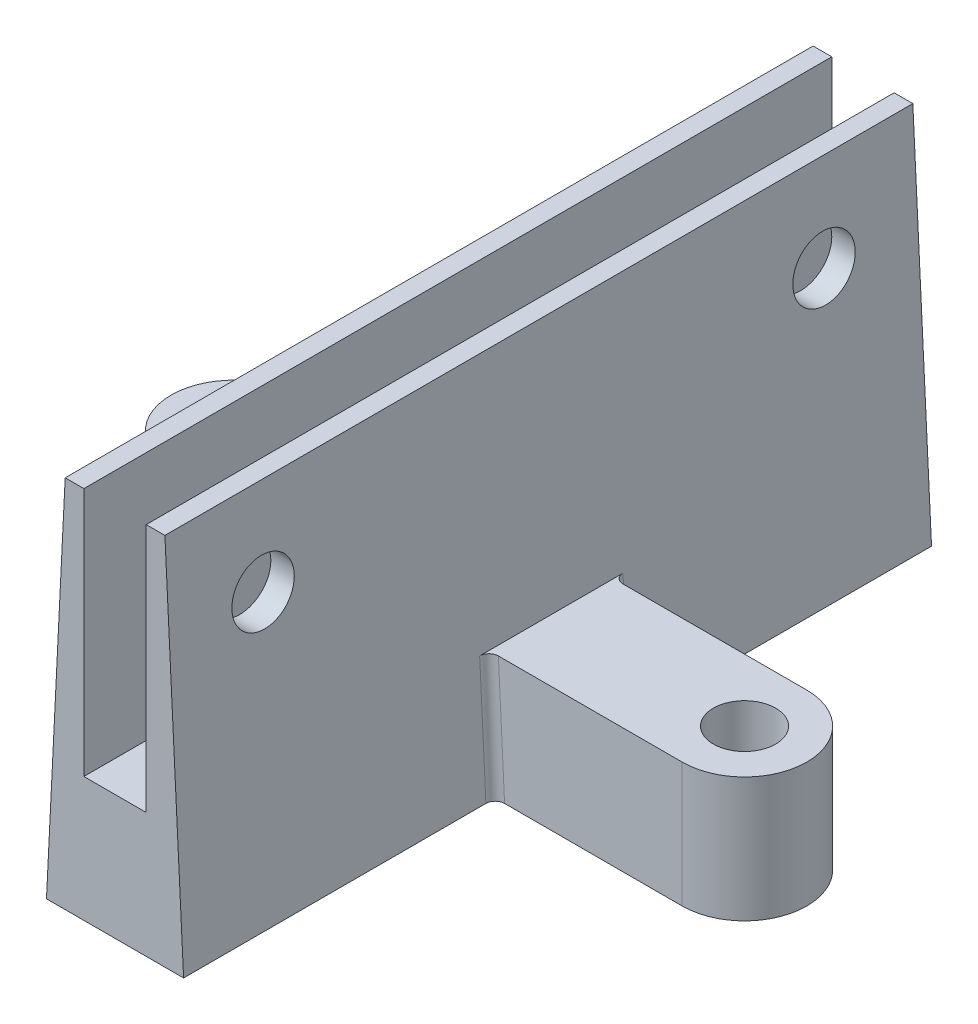
ISO-10303-21;
HEADER;
FILE_DESCRIPTION(('STEP AP214'),'2;1');
FILE_NAME('part.step','',(''),(''),'','','');
FILE_SCHEMA(('AUTOMOTIVE_DESIGN { 1 0 10303 214 1 1 1 1 }'));
ENDSEC;
DATA;
#1=APPLICATION_CONTEXT('core data for automotive mechanical design processes');
#2=APPLICATION_PROTOCOL_DEFINITION('international standard','automotive_design',2000,#1);
#3=PRODUCT_CONTEXT('',#1,'mechanical');
#4=PRODUCT('Part','Part','',(#3));
#5=PRODUCT_RELATED_PRODUCT_CATEGORY('part','',(#4));
#6=PRODUCT_DEFINITION_FORMATION('','',#4);
#7=PRODUCT_DEFINITION_CONTEXT('part definition',#1,'design');
#8=PRODUCT_DEFINITION('design','',#6,#7);
#9=PRODUCT_DEFINITION_SHAPE('','',#8);
#10=(LENGTH_UNIT() NAMED_UNIT(*) SI_UNIT(.MILLI.,.METRE.));
#11=(NAMED_UNIT(*) PLANE_ANGLE_UNIT() SI_UNIT($,.RADIAN.));
#12=(NAMED_UNIT(*) SI_UNIT($,.STERADIAN.) SOLID_ANGLE_UNIT());
#13=UNCERTAINTY_MEASURE_WITH_UNIT(LENGTH_MEASURE(1.E-05),#10,'distance_accuracy_value','');
#14=(GEOMETRIC_REPRESENTATION_CONTEXT(3) GLOBAL_UNCERTAINTY_ASSIGNED_CONTEXT((#13)) GLOBAL_UNIT_ASSIGNED_CONTEXT((#10,
#11,#12)) REPRESENTATION_CONTEXT('',''));
#15=CARTESIAN_POINT('',(0.,0.,0.));
#16=DIRECTION('',(0.,0.,1.));
#17=DIRECTION('',(1.,0.,0.));
#18=AXIS2_PLACEMENT_3D('',#15,#16,#17);
#19=CARTESIAN_POINT('',(0.,0.,120.));
#20=DIRECTION('',(0.998752338877845,-0.0499376169438922,0.));
#21=DIRECTION('',(0.0499376169438922,0.998752338877845,0.));
#22=AXIS2_PLACEMENT_3D('',#19,#20,#21);
#23=PLANE('',#22);
#24=CARTESIAN_POINT('',(2.25,45.,105.));
#25=DIRECTION('',(0.998752338877845,-0.0499376169438922,0.));
#26=DIRECTION('',(-0.0499376169438922,-0.998752338877845,0.));
#27=AXIS2_PLACEMENT_3D('',#24,#25,#26);
#28=ELLIPSE('',#27,5.0062460986252,5.00000000000001);
#29=CARTESIAN_POINT('',(2.,40.,105.));
#30=VERTEX_POINT('',#29);
#31=EDGE_CURVE('E432',#30,#30,#28,.F.);
#32=ORIENTED_EDGE('',*,*,#31,.F.);
#33=EDGE_LOOP('',(#32));
#34=FACE_BOUND('',#33,.T.);
#35=CARTESIAN_POINT('',(2.25,45.,15.));
#36=DIRECTION('',(0.998752338877845,-0.0499376169438922,0.));
#37=DIRECTION('',(-0.0499376169438922,-0.998752338877845,0.));
#38=AXIS2_PLACEMENT_3D('',#35,#36,#37);
#39=ELLIPSE('',#38,5.0062460986252,5.);
#40=CARTESIAN_POINT('',(2.,40.,15.));
#41=VERTEX_POINT('',#40);
#42=EDGE_CURVE('E418',#41,#41,#39,.F.);
#43=ORIENTED_EDGE('',*,*,#42,.F.);
#44=EDGE_LOOP('',(#43));
#45=FACE_BOUND('',#44,.T.);
#46=DIRECTION('',(0.,0.,-1.));
#47=VECTOR('',#46,1.);
#48=CARTESIAN_POINT('',(0.,0.,120.));
#49=LINE('',#48,#47);
#50=CARTESIAN_POINT('',(0.,0.,48.5));
#51=VERTEX_POINT('',#50);
#52=CARTESIAN_POINT('',(0.,0.,0.));
#53=VERTEX_POINT('',#52);
#54=EDGE_CURVE('E345',#51,#53,#49,.T.);
#55=ORIENTED_EDGE('',*,*,#54,.F.);
#56=DIRECTION('',(0.0499376169438922,0.998752338877845,0.));
#57=VECTOR('',#56,1.);
#58=CARTESIAN_POINT('',(0.,0.,48.5));
#59=LINE('',#58,#57);
#60=CARTESIAN_POINT('',(1.,20.,48.5));
#61=VERTEX_POINT('',#60);
#62=EDGE_CURVE('E359',#51,#61,#59,.T.);
#63=ORIENTED_EDGE('',*,*,#62,.T.);
#64=DIRECTION('',(0.,0.,1.));
#65=VECTOR('',#64,1.);
#66=CARTESIAN_POINT('',(1.,20.,120.));
#67=LINE('',#66,#65);
#68=CARTESIAN_POINT('',(1.,20.,71.5));
#69=VERTEX_POINT('',#68);
#70=EDGE_CURVE('E350',#61,#69,#67,.T.);
#71=ORIENTED_EDGE('',*,*,#70,.T.);
#72=DIRECTION('',(0.0499376169438922,0.998752338877845,0.));
#73=VECTOR('',#72,1.);
#74=CARTESIAN_POINT('',(0.,0.,71.5));
#75=LINE('',#74,#73);
#76=CARTESIAN_POINT('',(0.,0.,71.5));
#77=VERTEX_POINT('',#76);
#78=EDGE_CURVE('E356',#69,#77,#75,.F.);
#79=ORIENTED_EDGE('',*,*,#78,.T.);
#80=CARTESIAN_POINT('',(0.,0.,120.));
#81=VERTEX_POINT('',#80);
#82=EDGE_CURVE('E346',#81,#77,#49,.T.);
#83=ORIENTED_EDGE('',*,*,#82,.F.);
#84=DIRECTION('',(-0.0499376169438922,-0.998752338877845,0.));
#85=VECTOR('',#84,1.);
#86=CARTESIAN_POINT('',(0.,0.,120.));
#87=LINE('',#86,#85);
#88=CARTESIAN_POINT('',(3.,60.,120.));
#89=VERTEX_POINT('',#88);
#90=EDGE_CURVE('E266',#89,#81,#87,.T.);
#91=ORIENTED_EDGE('',*,*,#90,.F.);
#92=DIRECTION('',(0.,0.,-1.));
#93=VECTOR('',#92,1.);
#94=CARTESIAN_POINT('',(3.,60.,120.));
#95=LINE('',#94,#93);
#96=CARTESIAN_POINT('',(3.,60.,0.));
#97=VERTEX_POINT('',#96);
#98=EDGE_CURVE('E292',#89,#97,#95,.T.);
#99=ORIENTED_EDGE('',*,*,#98,.T.);
#100=DIRECTION('',(-0.0499376169438922,-0.998752338877845,0.));
#101=VECTOR('',#100,1.);
#102=CARTESIAN_POINT('',(0.,0.,0.));
#103=LINE('',#102,#101);
#104=EDGE_CURVE('E265',#97,#53,#103,.T.);
#105=ORIENTED_EDGE('',*,*,#104,.T.);
#106=EDGE_LOOP('',(#55,#63,#71,#79,#83,#91,#99,#105));
#107=FACE_BOUND('',#106,.T.);
#108=ADVANCED_FACE('F51',(#34,#45,#107),#23,.F.);
#109=CARTESIAN_POINT('',(0.,0.,120.));
#110=DIRECTION('',(0.,1.,0.));
#111=DIRECTION('',(0.,0.,1.));
#112=AXIS2_PLACEMENT_3D('',#109,#110,#111);
#113=PLANE('',#112);
#114=CARTESIAN_POINT('',(-30.,0.,60.));
#115=DIRECTION('',(0.,-1.,0.));
#116=DIRECTION('',(0.,0.,-1.));
#117=AXIS2_PLACEMENT_3D('',#114,#115,#116);
#118=CIRCLE('',#117,5.);
#119=CARTESIAN_POINT('',(-30.,0.,55.));
#120=VERTEX_POINT('',#119);
#121=EDGE_CURVE('E226',#120,#120,#118,.T.);
#122=ORIENTED_EDGE('',*,*,#121,.F.);
#123=EDGE_LOOP('',(#122));
#124=FACE_BOUND('',#123,.T.);
#125=CARTESIAN_POINT('',(52.,0.,60.));
#126=DIRECTION('',(0.,-1.,0.));
#127=DIRECTION('',(0.,0.,-1.));
#128=AXIS2_PLACEMENT_3D('',#125,#126,#127);
#129=CIRCLE('',#128,5.00000000000001);
#130=CARTESIAN_POINT('',(52.,0.,55.));
#131=VERTEX_POINT('',#130);
#132=EDGE_CURVE('E435',#131,#131,#129,.T.);
#133=ORIENTED_EDGE('',*,*,#132,.F.);
#134=EDGE_LOOP('',(#133));
#135=FACE_BOUND('',#134,.T.);
#136=DIRECTION('',(0.,0.,-1.));
#137=VECTOR('',#136,1.);
#138=CARTESIAN_POINT('',(22.,0.,120.));
#139=LINE('',#138,#137);
#140=CARTESIAN_POINT('',(22.,0.,48.5));
#141=VERTEX_POINT('',#140);
#142=CARTESIAN_POINT('',(22.,0.,0.));
#143=VERTEX_POINT('',#142);
#144=EDGE_CURVE('E340',#141,#143,#139,.T.);
#145=ORIENTED_EDGE('',*,*,#144,.F.);
#146=CARTESIAN_POINT('',(23.5018738295876,0.,48.5));
#147=DIRECTION('',(0.,1.,0.));
#148=DIRECTION('',(1.,0.,0.));
#149=AXIS2_PLACEMENT_3D('',#146,#147,#148);
#150=ELLIPSE('',#149,1.50187382958756,1.5);
#151=CARTESIAN_POINT('',(23.5018738295876,0.,50.));
#152=VERTEX_POINT('',#151);
#153=EDGE_CURVE('E196',#141,#152,#150,.T.);
#154=ORIENTED_EDGE('',*,*,#153,.T.);
#155=DIRECTION('',(1.,0.,0.));
#156=VECTOR('',#155,1.);
#157=CARTESIAN_POINT('',(17.,0.,50.));
#158=LINE('',#157,#156);
#159=CARTESIAN_POINT('',(52.,0.,50.));
#160=VERTEX_POINT('',#159);
#161=EDGE_CURVE('E189',#152,#160,#158,.T.);
#162=ORIENTED_EDGE('',*,*,#161,.T.);
#163=CARTESIAN_POINT('',(52.,0.,60.));
#164=DIRECTION('',(0.,-1.,0.));
#165=DIRECTION('',(0.,0.,1.));
#166=AXIS2_PLACEMENT_3D('',#163,#164,#165);
#167=CIRCLE('',#166,9.99999999999999);
#168=CARTESIAN_POINT('',(52.,0.,70.));
#169=VERTEX_POINT('',#168);
#170=EDGE_CURVE('E195',#160,#169,#167,.T.);
#171=ORIENTED_EDGE('',*,*,#170,.T.);
#172=DIRECTION('',(1.,0.,0.));
#173=VECTOR('',#172,1.);
#174=CARTESIAN_POINT('',(17.,0.,70.));
#175=LINE('',#174,#173);
#176=CARTESIAN_POINT('',(23.5018738295876,0.,70.));
#177=VERTEX_POINT('',#176);
#178=EDGE_CURVE('E201',#177,#169,#175,.T.);
#179=ORIENTED_EDGE('',*,*,#178,.F.);
#180=CARTESIAN_POINT('',(23.5018738295876,0.,71.5));
#181=DIRECTION('',(0.,1.,0.));
#182=DIRECTION('',(-1.,0.,0.));
#183=AXIS2_PLACEMENT_3D('',#180,#181,#182);
#184=ELLIPSE('',#183,1.50187382958756,1.5);
#185=CARTESIAN_POINT('',(22.,0.,71.5));
#186=VERTEX_POINT('',#185);
#187=EDGE_CURVE('E61',#177,#186,#184,.T.);
#188=ORIENTED_EDGE('',*,*,#187,.T.);
#189=CARTESIAN_POINT('',(22.,0.,120.));
#190=VERTEX_POINT('',#189);
#191=EDGE_CURVE('E341',#190,#186,#139,.T.);
#192=ORIENTED_EDGE('',*,*,#191,.F.);
#193=DIRECTION('',(1.,0.,0.));
#194=VECTOR('',#193,1.);
#195=CARTESIAN_POINT('',(0.,0.,120.));
#196=LINE('',#195,#194);
#197=EDGE_CURVE('E270',#81,#190,#196,.T.);
#198=ORIENTED_EDGE('',*,*,#197,.F.);
#199=ORIENTED_EDGE('',*,*,#82,.T.);
#200=CARTESIAN_POINT('',(-1.50187382958756,0.,71.5));
#201=DIRECTION('',(0.,1.,0.));
#202=DIRECTION('',(-1.,0.,0.));
#203=AXIS2_PLACEMENT_3D('',#200,#201,#202);
#204=ELLIPSE('',#203,1.50187382958756,1.5);
#205=CARTESIAN_POINT('',(-1.50187382958756,0.,70.));
#206=VERTEX_POINT('',#205);
#207=EDGE_CURVE('E394',#77,#206,#204,.T.);
#208=ORIENTED_EDGE('',*,*,#207,.T.);
#209=DIRECTION('',(-1.,0.,0.));
#210=VECTOR('',#209,1.);
#211=CARTESIAN_POINT('',(4.,0.,70.));
#212=LINE('',#211,#210);
#213=CARTESIAN_POINT('',(-30.,0.,70.));
#214=VERTEX_POINT('',#213);
#215=EDGE_CURVE('E253',#206,#214,#212,.T.);
#216=ORIENTED_EDGE('',*,*,#215,.T.);
#217=CARTESIAN_POINT('',(-30.,0.,60.));
#218=DIRECTION('',(0.,-1.,0.));
#219=DIRECTION('',(0.,0.,-1.));
#220=AXIS2_PLACEMENT_3D('',#217,#218,#219);
#221=CIRCLE('',#220,10.);
#222=CARTESIAN_POINT('',(-30.,0.,50.));
#223=VERTEX_POINT('',#222);
#224=EDGE_CURVE('E223',#214,#223,#221,.T.);
#225=ORIENTED_EDGE('',*,*,#224,.T.);
#226=DIRECTION('',(-1.,0.,0.));
#227=VECTOR('',#226,1.);
#228=CARTESIAN_POINT('',(4.,0.,50.));
#229=LINE('',#228,#227);
#230=CARTESIAN_POINT('',(-1.50187382958756,0.,50.));
#231=VERTEX_POINT('',#230);
#232=EDGE_CURVE('E262',#231,#223,#229,.T.);
#233=ORIENTED_EDGE('',*,*,#232,.F.);
#234=CARTESIAN_POINT('',(-1.50187382958756,0.,48.5));
#235=DIRECTION('',(0.,1.,0.));
#236=DIRECTION('',(1.,0.,0.));
#237=AXIS2_PLACEMENT_3D('',#234,#235,#236);
#238=ELLIPSE('',#237,1.50187382958756,1.5);
#239=EDGE_CURVE('E387',#231,#51,#238,.T.);
#240=ORIENTED_EDGE('',*,*,#239,.T.);
#241=ORIENTED_EDGE('',*,*,#54,.T.);
#242=DIRECTION('',(1.,0.,0.));
#243=VECTOR('',#242,1.);
#244=CARTESIAN_POINT('',(0.,0.,0.));
#245=LINE('',#244,#243);
#246=EDGE_CURVE('E296',#53,#143,#245,.T.);
#247=ORIENTED_EDGE('',*,*,#246,.T.);
#248=EDGE_LOOP('',(#145,#154,#162,#171,#179,#188,#192,#198,#199,#208,#216,#225,#233,#240,#241,#247));
#249=FACE_BOUND('',#248,.T.);
#250=ADVANCED_FACE('F192',(#124,#135,#249),#113,.F.);
#251=CARTESIAN_POINT('',(22.,0.,120.));
#252=DIRECTION('',(-0.998752338877845,-0.0499376169438922,0.));
#253=DIRECTION('',(0.0499376169438922,-0.998752338877845,0.));
#254=AXIS2_PLACEMENT_3D('',#251,#252,#253);
#255=PLANE('',#254);
#256=CARTESIAN_POINT('',(19.75,45.,105.));
#257=DIRECTION('',(-0.998752338877845,-0.0499376169438922,0.));
#258=DIRECTION('',(-0.0499376169438922,0.998752338877845,0.));
#259=AXIS2_PLACEMENT_3D('',#256,#257,#258);
#260=ELLIPSE('',#259,5.0062460986252,5.00000000000001);
#261=CARTESIAN_POINT('',(19.5,50.,105.));
#262=VERTEX_POINT('',#261);
#263=EDGE_CURVE('E428',#262,#262,#260,.F.);
#264=ORIENTED_EDGE('',*,*,#263,.F.);
#265=EDGE_LOOP('',(#264));
#266=FACE_BOUND('',#265,.T.);
#267=CARTESIAN_POINT('',(19.75,45.,15.));
#268=DIRECTION('',(-0.998752338877845,-0.0499376169438922,0.));
#269=DIRECTION('',(-0.0499376169438922,0.998752338877845,0.));
#270=AXIS2_PLACEMENT_3D('',#267,#268,#269);
#271=ELLIPSE('',#270,5.0062460986252,5.);
#272=CARTESIAN_POINT('',(19.5,50.,15.));
#273=VERTEX_POINT('',#272);
#274=EDGE_CURVE('E412',#273,#273,#271,.F.);
#275=ORIENTED_EDGE('',*,*,#274,.F.);
#276=EDGE_LOOP('',(#275));
#277=FACE_BOUND('',#276,.T.);
#278=DIRECTION('',(0.,0.,1.));
#279=VECTOR('',#278,1.);
#280=CARTESIAN_POINT('',(21.,20.,120.));
#281=LINE('',#280,#279);
#282=CARTESIAN_POINT('',(21.,20.,48.5));
#283=VERTEX_POINT('',#282);
#284=CARTESIAN_POINT('',(21.,20.,71.5));
#285=VERTEX_POINT('',#284);
#286=EDGE_CURVE('E353',#283,#285,#281,.T.);
#287=ORIENTED_EDGE('',*,*,#286,.F.);
#288=DIRECTION('',(0.0499376169438922,-0.998752338877845,0.));
#289=VECTOR('',#288,1.);
#290=CARTESIAN_POINT('',(22.,0.,48.5));
#291=LINE('',#290,#289);
#292=EDGE_CURVE('E374',#283,#141,#291,.T.);
#293=ORIENTED_EDGE('',*,*,#292,.T.);
#294=ORIENTED_EDGE('',*,*,#144,.T.);
#295=DIRECTION('',(-0.0499376169438922,0.998752338877845,0.));
#296=VECTOR('',#295,1.);
#297=CARTESIAN_POINT('',(22.,0.,0.));
#298=LINE('',#297,#296);
#299=CARTESIAN_POINT('',(19.,60.,0.));
#300=VERTEX_POINT('',#299);
#301=EDGE_CURVE('E300',#143,#300,#298,.T.);
#302=ORIENTED_EDGE('',*,*,#301,.T.);
#303=DIRECTION('',(0.,0.,-1.));
#304=VECTOR('',#303,1.);
#305=CARTESIAN_POINT('',(19.,60.,120.));
#306=LINE('',#305,#304);
#307=CARTESIAN_POINT('',(19.,60.,120.));
#308=VERTEX_POINT('',#307);
#309=EDGE_CURVE('E336',#308,#300,#306,.T.);
#310=ORIENTED_EDGE('',*,*,#309,.F.);
#311=DIRECTION('',(-0.0499376169438922,0.998752338877845,0.));
#312=VECTOR('',#311,1.);
#313=CARTESIAN_POINT('',(22.,0.,120.));
#314=LINE('',#313,#312);
#315=EDGE_CURVE('E274',#190,#308,#314,.T.);
#316=ORIENTED_EDGE('',*,*,#315,.F.);
#317=ORIENTED_EDGE('',*,*,#191,.T.);
#318=DIRECTION('',(0.0499376169438922,-0.998752338877845,0.));
#319=VECTOR('',#318,1.);
#320=CARTESIAN_POINT('',(21.,20.,71.5));
#321=LINE('',#320,#319);
#322=EDGE_CURVE('E370',#186,#285,#321,.F.);
#323=ORIENTED_EDGE('',*,*,#322,.T.);
#324=EDGE_LOOP('',(#287,#293,#294,#302,#310,#316,#317,#323));
#325=FACE_BOUND('',#324,.T.);
#326=ADVANCED_FACE('F450',(#266,#277,#325),#255,.F.);
#327=CARTESIAN_POINT('',(16.,60.,120.));
#328=DIRECTION('',(0.,-1.,0.));
#329=DIRECTION('',(0.,0.,-1.));
#330=AXIS2_PLACEMENT_3D('',#327,#328,#329);
#331=PLANE('',#330);
#332=DIRECTION('',(-1.,0.,0.));
#333=VECTOR('',#332,1.);
#334=CARTESIAN_POINT('',(16.,60.,0.));
#335=LINE('',#334,#333);
#336=CARTESIAN_POINT('',(16.,60.,0.));
#337=VERTEX_POINT('',#336);
#338=EDGE_CURVE('E303',#300,#337,#335,.T.);
#339=ORIENTED_EDGE('',*,*,#338,.T.);
#340=DIRECTION('',(0.,0.,-1.));
#341=VECTOR('',#340,1.);
#342=CARTESIAN_POINT('',(16.,60.,120.));
#343=LINE('',#342,#341);
#344=CARTESIAN_POINT('',(16.,60.,120.));
#345=VERTEX_POINT('',#344);
#346=EDGE_CURVE('E332',#345,#337,#343,.T.);
#347=ORIENTED_EDGE('',*,*,#346,.F.);
#348=DIRECTION('',(-1.,0.,0.));
#349=VECTOR('',#348,1.);
#350=CARTESIAN_POINT('',(16.,60.,120.));
#351=LINE('',#350,#349);
#352=EDGE_CURVE('E277',#308,#345,#351,.T.);
#353=ORIENTED_EDGE('',*,*,#352,.F.);
#354=ORIENTED_EDGE('',*,*,#309,.T.);
#355=EDGE_LOOP('',(#339,#347,#353,#354));
#356=FACE_BOUND('',#355,.T.);
#357=ADVANCED_FACE('F457',(#356),#331,.F.);
#358=CARTESIAN_POINT('',(16.,20.,120.));
#359=DIRECTION('',(1.,0.,0.));
#360=DIRECTION('',(0.,0.,-1.));
#361=AXIS2_PLACEMENT_3D('',#358,#359,#360);
#362=PLANE('',#361);
#363=CARTESIAN_POINT('',(16.,45.,105.));
#364=DIRECTION('',(1.,0.,0.));
#365=DIRECTION('',(0.,0.,-1.));
#366=AXIS2_PLACEMENT_3D('',#363,#364,#365);
#367=CIRCLE('',#366,5.00000000000001);
#368=CARTESIAN_POINT('',(16.,45.,100.));
#369=VERTEX_POINT('',#368);
#370=EDGE_CURVE('E424',#369,#369,#367,.F.);
#371=ORIENTED_EDGE('',*,*,#370,.F.);
#372=EDGE_LOOP('',(#371));
#373=FACE_BOUND('',#372,.T.);
#374=CARTESIAN_POINT('',(16.,45.,15.));
#375=DIRECTION('',(1.,0.,0.));
#376=DIRECTION('',(0.,0.,-1.));
#377=AXIS2_PLACEMENT_3D('',#374,#375,#376);
#378=CIRCLE('',#377,5.);
#379=CARTESIAN_POINT('',(16.,45.,10.));
#380=VERTEX_POINT('',#379);
#381=EDGE_CURVE('E407',#380,#380,#378,.F.);
#382=ORIENTED_EDGE('',*,*,#381,.F.);
#383=EDGE_LOOP('',(#382));
#384=FACE_BOUND('',#383,.T.);
#385=DIRECTION('',(0.,-1.,0.));
#386=VECTOR('',#385,1.);
#387=CARTESIAN_POINT('',(16.,20.,0.));
#388=LINE('',#387,#386);
#389=CARTESIAN_POINT('',(16.,20.,0.));
#390=VERTEX_POINT('',#389);
#391=EDGE_CURVE('E306',#337,#390,#388,.T.);
#392=ORIENTED_EDGE('',*,*,#391,.T.);
#393=DIRECTION('',(0.,0.,-1.));
#394=VECTOR('',#393,1.);
#395=CARTESIAN_POINT('',(16.,20.,120.));
#396=LINE('',#395,#394);
#397=CARTESIAN_POINT('',(16.,20.,120.));
#398=VERTEX_POINT('',#397);
#399=EDGE_CURVE('E328',#398,#390,#396,.T.);
#400=ORIENTED_EDGE('',*,*,#399,.F.);
#401=DIRECTION('',(0.,-1.,0.));
#402=VECTOR('',#401,1.);
#403=CARTESIAN_POINT('',(16.,20.,120.));
#404=LINE('',#403,#402);
#405=EDGE_CURVE('E280',#345,#398,#404,.T.);
#406=ORIENTED_EDGE('',*,*,#405,.F.);
#407=ORIENTED_EDGE('',*,*,#346,.T.);
#408=EDGE_LOOP('',(#392,#400,#406,#407));
#409=FACE_BOUND('',#408,.T.);
#410=ADVANCED_FACE('F533',(#373,#384,#409),#362,.F.);
#411=CARTESIAN_POINT('',(6.,20.,120.));
#412=DIRECTION('',(0.,-1.,0.));
#413=DIRECTION('',(0.,0.,-1.));
#414=AXIS2_PLACEMENT_3D('',#411,#412,#413);
#415=PLANE('',#414);
#416=DIRECTION('',(-1.,0.,0.));
#417=VECTOR('',#416,1.);
#418=CARTESIAN_POINT('',(6.,20.,0.));
#419=LINE('',#418,#417);
#420=CARTESIAN_POINT('',(6.,20.,0.));
#421=VERTEX_POINT('',#420);
#422=EDGE_CURVE('E309',#390,#421,#419,.T.);
#423=ORIENTED_EDGE('',*,*,#422,.T.);
#424=DIRECTION('',(0.,0.,-1.));
#425=VECTOR('',#424,1.);
#426=CARTESIAN_POINT('',(6.,20.,120.));
#427=LINE('',#426,#425);
#428=CARTESIAN_POINT('',(6.,20.,120.));
#429=VERTEX_POINT('',#428);
#430=EDGE_CURVE('E324',#429,#421,#427,.T.);
#431=ORIENTED_EDGE('',*,*,#430,.F.);
#432=DIRECTION('',(-1.,0.,0.));
#433=VECTOR('',#432,1.);
#434=CARTESIAN_POINT('',(6.,20.,120.));
#435=LINE('',#434,#433);
#436=EDGE_CURVE('E283',#398,#429,#435,.T.);
#437=ORIENTED_EDGE('',*,*,#436,.F.);
#438=ORIENTED_EDGE('',*,*,#399,.T.);
#439=EDGE_LOOP('',(#423,#431,#437,#438));
#440=FACE_BOUND('',#439,.T.);
#441=ADVANCED_FACE('F540',(#440),#415,.F.);
#442=CARTESIAN_POINT('',(6.,20.,120.));
#443=DIRECTION('',(-1.,0.,0.));
#444=DIRECTION('',(0.,0.,1.));
#445=AXIS2_PLACEMENT_3D('',#442,#443,#444);
#446=PLANE('',#445);
#447=CARTESIAN_POINT('',(6.,45.,105.));
#448=DIRECTION('',(-1.,0.,0.));
#449=DIRECTION('',(0.,0.,1.));
#450=AXIS2_PLACEMENT_3D('',#447,#448,#449);
#451=CIRCLE('',#450,5.00000000000001);
#452=CARTESIAN_POINT('',(6.,45.,110.));
#453=VERTEX_POINT('',#452);
#454=EDGE_CURVE('E55',#453,#453,#451,.F.);
#455=ORIENTED_EDGE('',*,*,#454,.F.);
#456=EDGE_LOOP('',(#455));
#457=FACE_BOUND('',#456,.T.);
#458=CARTESIAN_POINT('',(6.,45.,15.));
#459=DIRECTION('',(-1.,0.,0.));
#460=DIRECTION('',(0.,0.,1.));
#461=AXIS2_PLACEMENT_3D('',#458,#459,#460);
#462=CIRCLE('',#461,5.);
#463=CARTESIAN_POINT('',(6.,45.,20.));
#464=VERTEX_POINT('',#463);
#465=EDGE_CURVE('E404',#464,#464,#462,.F.);
#466=ORIENTED_EDGE('',*,*,#465,.F.);
#467=EDGE_LOOP('',(#466));
#468=FACE_BOUND('',#467,.T.);
#469=DIRECTION('',(0.,1.,0.));
#470=VECTOR('',#469,1.);
#471=CARTESIAN_POINT('',(6.,20.,0.));
#472=LINE('',#471,#470);
#473=CARTESIAN_POINT('',(6.,60.,0.));
#474=VERTEX_POINT('',#473);
#475=EDGE_CURVE('E312',#421,#474,#472,.T.);
#476=ORIENTED_EDGE('',*,*,#475,.T.);
#477=DIRECTION('',(0.,0.,-1.));
#478=VECTOR('',#477,1.);
#479=CARTESIAN_POINT('',(6.,60.,120.));
#480=LINE('',#479,#478);
#481=CARTESIAN_POINT('',(6.,60.,120.));
#482=VERTEX_POINT('',#481);
#483=EDGE_CURVE('E320',#482,#474,#480,.T.);
#484=ORIENTED_EDGE('',*,*,#483,.F.);
#485=DIRECTION('',(0.,1.,0.));
#486=VECTOR('',#485,1.);
#487=CARTESIAN_POINT('',(6.,20.,120.));
#488=LINE('',#487,#486);
#489=EDGE_CURVE('E286',#429,#482,#488,.T.);
#490=ORIENTED_EDGE('',*,*,#489,.F.);
#491=ORIENTED_EDGE('',*,*,#430,.T.);
#492=EDGE_LOOP('',(#476,#484,#490,#491));
#493=FACE_BOUND('',#492,.T.);
#494=ADVANCED_FACE('F543',(#457,#468,#493),#446,.F.);
#495=CARTESIAN_POINT('',(6.,60.,120.));
#496=DIRECTION('',(0.,-1.,0.));
#497=DIRECTION('',(0.,0.,-1.));
#498=AXIS2_PLACEMENT_3D('',#495,#496,#497);
#499=PLANE('',#498);
#500=DIRECTION('',(-1.,0.,0.));
#501=VECTOR('',#500,1.);
#502=CARTESIAN_POINT('',(6.,60.,0.));
#503=LINE('',#502,#501);
#504=EDGE_CURVE('E271',#474,#97,#503,.T.);
#505=ORIENTED_EDGE('',*,*,#504,.T.);
#506=ORIENTED_EDGE('',*,*,#98,.F.);
#507=DIRECTION('',(-1.,0.,0.));
#508=VECTOR('',#507,1.);
#509=CARTESIAN_POINT('',(6.,60.,120.));
#510=LINE('',#509,#508);
#511=EDGE_CURVE('E289',#482,#89,#510,.T.);
#512=ORIENTED_EDGE('',*,*,#511,.F.);
#513=ORIENTED_EDGE('',*,*,#483,.T.);
#514=EDGE_LOOP('',(#505,#506,#512,#513));
#515=FACE_BOUND('',#514,.T.);
#516=ADVANCED_FACE('F548',(#515),#499,.F.);
#517=CARTESIAN_POINT('',(0.,0.,120.));
#518=DIRECTION('',(0.,0.,1.));
#519=DIRECTION('',(1.,0.,0.));
#520=AXIS2_PLACEMENT_3D('',#517,#518,#519);
#521=PLANE('',#520);
#522=ORIENTED_EDGE('',*,*,#90,.T.);
#523=ORIENTED_EDGE('',*,*,#197,.T.);
#524=ORIENTED_EDGE('',*,*,#315,.T.);
#525=ORIENTED_EDGE('',*,*,#352,.T.);
#526=ORIENTED_EDGE('',*,*,#405,.T.);
#527=ORIENTED_EDGE('',*,*,#436,.T.);
#528=ORIENTED_EDGE('',*,*,#489,.T.);
#529=ORIENTED_EDGE('',*,*,#511,.T.);
#530=EDGE_LOOP('',(#522,#523,#524,#525,#526,#527,#528,#529));
#531=FACE_BOUND('',#530,.T.);
#532=ADVANCED_FACE('F491',(#531),#521,.T.);
#533=CARTESIAN_POINT('',(0.,0.,0.));
#534=DIRECTION('',(0.,0.,1.));
#535=DIRECTION('',(1.,0.,0.));
#536=AXIS2_PLACEMENT_3D('',#533,#534,#535);
#537=PLANE('',#536);
#538=ORIENTED_EDGE('',*,*,#104,.F.);
#539=ORIENTED_EDGE('',*,*,#504,.F.);
#540=ORIENTED_EDGE('',*,*,#475,.F.);
#541=ORIENTED_EDGE('',*,*,#422,.F.);
#542=ORIENTED_EDGE('',*,*,#391,.F.);
#543=ORIENTED_EDGE('',*,*,#338,.F.);
#544=ORIENTED_EDGE('',*,*,#301,.F.);
#545=ORIENTED_EDGE('',*,*,#246,.F.);
#546=EDGE_LOOP('',(#538,#539,#540,#541,#542,#543,#544,#545));
#547=FACE_BOUND('',#546,.T.);
#548=ADVANCED_FACE('F527',(#547),#537,.F.);
#549=CARTESIAN_POINT('',(4.,20.,70.));
#550=DIRECTION('',(0.,1.,0.));
#551=DIRECTION('',(0.,0.,1.));
#552=AXIS2_PLACEMENT_3D('',#549,#550,#551);
#553=PLANE('',#552);
#554=CARTESIAN_POINT('',(-30.,20.,60.));
#555=DIRECTION('',(0.,-1.,0.));
#556=DIRECTION('',(0.,0.,-1.));
#557=AXIS2_PLACEMENT_3D('',#554,#555,#556);
#558=CIRCLE('',#557,5.);
#559=CARTESIAN_POINT('',(-30.,20.,55.));
#560=VERTEX_POINT('',#559);
#561=EDGE_CURVE('E219',#560,#560,#558,.T.);
#562=ORIENTED_EDGE('',*,*,#561,.T.);
#563=EDGE_LOOP('',(#562));
#564=FACE_BOUND('',#563,.T.);
#565=ORIENTED_EDGE('',*,*,#70,.F.);
#566=CARTESIAN_POINT('',(-0.501873829587559,20.,48.5));
#567=DIRECTION('',(0.,1.,0.));
#568=DIRECTION('',(1.,0.,0.));
#569=AXIS2_PLACEMENT_3D('',#566,#567,#568);
#570=ELLIPSE('',#569,1.50187382958756,1.5);
#571=CARTESIAN_POINT('',(-0.501873829587559,20.,50.));
#572=VERTEX_POINT('',#571);
#573=EDGE_CURVE('E384',#61,#572,#570,.F.);
#574=ORIENTED_EDGE('',*,*,#573,.T.);
#575=DIRECTION('',(-1.,0.,0.));
#576=VECTOR('',#575,1.);
#577=CARTESIAN_POINT('',(4.,20.,50.));
#578=LINE('',#577,#576);
#579=CARTESIAN_POINT('',(-30.,20.,50.));
#580=VERTEX_POINT('',#579);
#581=EDGE_CURVE('E259',#572,#580,#578,.T.);
#582=ORIENTED_EDGE('',*,*,#581,.T.);
#583=CARTESIAN_POINT('',(-30.,20.,60.));
#584=DIRECTION('',(0.,-1.,0.));
#585=DIRECTION('',(0.,0.,-1.));
#586=AXIS2_PLACEMENT_3D('',#583,#584,#585);
#587=CIRCLE('',#586,10.);
#588=CARTESIAN_POINT('',(-30.,20.,70.));
#589=VERTEX_POINT('',#588);
#590=EDGE_CURVE('E212',#589,#580,#587,.T.);
#591=ORIENTED_EDGE('',*,*,#590,.F.);
#592=DIRECTION('',(-1.,0.,0.));
#593=VECTOR('',#592,1.);
#594=CARTESIAN_POINT('',(4.,20.,70.));
#595=LINE('',#594,#593);
#596=CARTESIAN_POINT('',(-0.501873829587559,20.,70.));
#597=VERTEX_POINT('',#596);
#598=EDGE_CURVE('E256',#597,#589,#595,.T.);
#599=ORIENTED_EDGE('',*,*,#598,.F.);
#600=CARTESIAN_POINT('',(-0.501873829587559,20.,71.5));
#601=DIRECTION('',(0.,1.,0.));
#602=DIRECTION('',(-1.,0.,0.));
#603=AXIS2_PLACEMENT_3D('',#600,#601,#602);
#604=ELLIPSE('',#603,1.50187382958756,1.5);
#605=EDGE_CURVE('E390',#597,#69,#604,.F.);
#606=ORIENTED_EDGE('',*,*,#605,.T.);
#607=EDGE_LOOP('',(#565,#574,#582,#591,#599,#606));
#608=FACE_BOUND('',#607,.T.);
#609=ADVANCED_FACE('F506',(#564,#608),#553,.T.);
#610=CARTESIAN_POINT('',(4.,20.,50.));
#611=DIRECTION('',(0.,0.,-1.));
#612=DIRECTION('',(-1.,0.,0.));
#613=AXIS2_PLACEMENT_3D('',#610,#611,#612);
#614=PLANE('',#613);
#615=ORIENTED_EDGE('',*,*,#581,.F.);
#616=DIRECTION('',(0.0499376169438922,0.998752338877845,0.));
#617=VECTOR('',#616,1.);
#618=CARTESIAN_POINT('',(-0.490647211558662,20.2245323605779,50.));
#619=LINE('',#618,#617);
#620=EDGE_CURVE('E363',#572,#231,#619,.F.);
#621=ORIENTED_EDGE('',*,*,#620,.T.);
#622=ORIENTED_EDGE('',*,*,#232,.T.);
#623=DIRECTION('',(0.,-1.,0.));
#624=VECTOR('',#623,1.);
#625=CARTESIAN_POINT('',(-30.,20.,50.));
#626=LINE('',#625,#624);
#627=EDGE_CURVE('E245',#580,#223,#626,.T.);
#628=ORIENTED_EDGE('',*,*,#627,.F.);
#629=EDGE_LOOP('',(#615,#621,#622,#628));
#630=FACE_BOUND('',#629,.T.);
#631=ADVANCED_FACE('F513',(#630),#614,.T.);
#632=CARTESIAN_POINT('',(4.,20.,70.));
#633=DIRECTION('',(0.,0.,-1.));
#634=DIRECTION('',(-1.,0.,0.));
#635=AXIS2_PLACEMENT_3D('',#632,#633,#634);
#636=PLANE('',#635);
#637=ORIENTED_EDGE('',*,*,#215,.F.);
#638=DIRECTION('',(0.0499376169438922,0.998752338877845,0.));
#639=VECTOR('',#638,1.);
#640=CARTESIAN_POINT('',(-0.498128508316767,20.0749064254158,70.));
#641=LINE('',#640,#639);
#642=EDGE_CURVE('E366',#206,#597,#641,.T.);
#643=ORIENTED_EDGE('',*,*,#642,.T.);
#644=ORIENTED_EDGE('',*,*,#598,.T.);
#645=DIRECTION('',(0.,-1.,0.));
#646=VECTOR('',#645,1.);
#647=CARTESIAN_POINT('',(-30.,20.,70.));
#648=LINE('',#647,#646);
#649=EDGE_CURVE('E249',#589,#214,#648,.T.);
#650=ORIENTED_EDGE('',*,*,#649,.T.);
#651=EDGE_LOOP('',(#637,#643,#644,#650));
#652=FACE_BOUND('',#651,.T.);
#653=ADVANCED_FACE('F502',(#652),#636,.F.);
#654=CARTESIAN_POINT('',(17.,20.,70.));
#655=DIRECTION('',(0.,-1.,0.));
#656=DIRECTION('',(0.,0.,-1.));
#657=AXIS2_PLACEMENT_3D('',#654,#655,#656);
#658=PLANE('',#657);
#659=CARTESIAN_POINT('',(52.,20.,60.));
#660=DIRECTION('',(0.,-1.,0.));
#661=DIRECTION('',(0.,0.,-1.));
#662=AXIS2_PLACEMENT_3D('',#659,#660,#661);
#663=CIRCLE('',#662,5.00000000000001);
#664=CARTESIAN_POINT('',(52.,20.,55.));
#665=VERTEX_POINT('',#664);
#666=EDGE_CURVE('E440',#665,#665,#663,.T.);
#667=ORIENTED_EDGE('',*,*,#666,.T.);
#668=EDGE_LOOP('',(#667));
#669=FACE_BOUND('',#668,.T.);
#670=DIRECTION('',(1.,0.,0.));
#671=VECTOR('',#670,1.);
#672=CARTESIAN_POINT('',(17.,20.,50.));
#673=LINE('',#672,#671);
#674=CARTESIAN_POINT('',(22.5018738295876,20.,50.));
#675=VERTEX_POINT('',#674);
#676=CARTESIAN_POINT('',(52.,20.,50.));
#677=VERTEX_POINT('',#676);
#678=EDGE_CURVE('E200',#675,#677,#673,.T.);
#679=ORIENTED_EDGE('',*,*,#678,.F.);
#680=CARTESIAN_POINT('',(22.5018738295876,20.,48.5));
#681=DIRECTION('',(0.,-1.,0.));
#682=DIRECTION('',(1.,0.,0.));
#683=AXIS2_PLACEMENT_3D('',#680,#681,#682);
#684=ELLIPSE('',#683,1.50187382958756,1.5);
#685=EDGE_CURVE('E399',#675,#283,#684,.T.);
#686=ORIENTED_EDGE('',*,*,#685,.T.);
#687=ORIENTED_EDGE('',*,*,#286,.T.);
#688=CARTESIAN_POINT('',(22.5018738295876,20.,71.5));
#689=DIRECTION('',(0.,-1.,0.));
#690=DIRECTION('',(-1.,0.,0.));
#691=AXIS2_PLACEMENT_3D('',#688,#689,#690);
#692=ELLIPSE('',#691,1.50187382958756,1.5);
#693=CARTESIAN_POINT('',(22.5018738295876,20.,70.));
#694=VERTEX_POINT('',#693);
#695=EDGE_CURVE('E13',#285,#694,#692,.T.);
#696=ORIENTED_EDGE('',*,*,#695,.T.);
#697=DIRECTION('',(1.,0.,0.));
#698=VECTOR('',#697,1.);
#699=CARTESIAN_POINT('',(17.,20.,70.));
#700=LINE('',#699,#698);
#701=CARTESIAN_POINT('',(52.,20.,70.));
#702=VERTEX_POINT('',#701);
#703=EDGE_CURVE('E238',#694,#702,#700,.T.);
#704=ORIENTED_EDGE('',*,*,#703,.T.);
#705=CARTESIAN_POINT('',(52.,20.,60.));
#706=DIRECTION('',(0.,-1.,0.));
#707=DIRECTION('',(0.,0.,1.));
#708=AXIS2_PLACEMENT_3D('',#705,#706,#707);
#709=CIRCLE('',#708,9.99999999999999);
#710=EDGE_CURVE('E218',#677,#702,#709,.T.);
#711=ORIENTED_EDGE('',*,*,#710,.F.);
#712=EDGE_LOOP('',(#679,#686,#687,#696,#704,#711));
#713=FACE_BOUND('',#712,.T.);
#714=ADVANCED_FACE('F482',(#669,#713),#658,.F.);
#715=CARTESIAN_POINT('',(17.,0.,50.));
#716=DIRECTION('',(0.,0.,-1.));
#717=DIRECTION('',(-1.,0.,0.));
#718=AXIS2_PLACEMENT_3D('',#715,#716,#717);
#719=PLANE('',#718);
#720=ORIENTED_EDGE('',*,*,#161,.F.);
#721=DIRECTION('',(0.0499376169438922,-0.998752338877845,0.));
#722=VECTOR('',#721,1.);
#723=CARTESIAN_POINT('',(23.4856596803866,0.324282984019327,50.));
#724=LINE('',#723,#722);
#725=EDGE_CURVE('E378',#152,#675,#724,.F.);
#726=ORIENTED_EDGE('',*,*,#725,.T.);
#727=ORIENTED_EDGE('',*,*,#678,.T.);
#728=DIRECTION('',(0.,1.,0.));
#729=VECTOR('',#728,1.);
#730=CARTESIAN_POINT('',(52.,0.,50.));
#731=LINE('',#730,#729);
#732=EDGE_CURVE('E204',#160,#677,#731,.T.);
#733=ORIENTED_EDGE('',*,*,#732,.F.);
#734=EDGE_LOOP('',(#720,#726,#727,#733));
#735=FACE_BOUND('',#734,.T.);
#736=ADVANCED_FACE('F205',(#735),#719,.T.);
#737=CARTESIAN_POINT('',(17.,0.,70.));
#738=DIRECTION('',(0.,0.,-1.));
#739=DIRECTION('',(-1.,0.,0.));
#740=AXIS2_PLACEMENT_3D('',#737,#738,#739);
#741=PLANE('',#740);
#742=ORIENTED_EDGE('',*,*,#703,.F.);
#743=DIRECTION('',(0.0499376169438922,-0.998752338877845,0.));
#744=VECTOR('',#743,1.);
#745=CARTESIAN_POINT('',(23.4981285083168,0.0749064254158359,70.));
#746=LINE('',#745,#744);
#747=EDGE_CURVE('E381',#694,#177,#746,.T.);
#748=ORIENTED_EDGE('',*,*,#747,.T.);
#749=ORIENTED_EDGE('',*,*,#178,.T.);
#750=DIRECTION('',(0.,1.,0.));
#751=VECTOR('',#750,1.);
#752=CARTESIAN_POINT('',(52.,0.,70.));
#753=LINE('',#752,#751);
#754=EDGE_CURVE('E211',#169,#702,#753,.T.);
#755=ORIENTED_EDGE('',*,*,#754,.T.);
#756=EDGE_LOOP('',(#742,#748,#749,#755));
#757=FACE_BOUND('',#756,.T.);
#758=ADVANCED_FACE('F484',(#757),#741,.F.);
#759=CARTESIAN_POINT('',(-30.,20.,60.));
#760=DIRECTION('',(0.,-1.,0.));
#761=DIRECTION('',(0.,0.,-1.));
#762=AXIS2_PLACEMENT_3D('',#759,#760,#761);
#763=CYLINDRICAL_SURFACE('',#762,10.);
#764=ORIENTED_EDGE('',*,*,#224,.F.);
#765=ORIENTED_EDGE('',*,*,#649,.F.);
#766=ORIENTED_EDGE('',*,*,#590,.T.);
#767=ORIENTED_EDGE('',*,*,#627,.T.);
#768=EDGE_LOOP('',(#764,#765,#766,#767));
#769=FACE_BOUND('',#768,.T.);
#770=ADVANCED_FACE('F511',(#769),#763,.T.);
#771=CARTESIAN_POINT('',(52.,20.,60.));
#772=DIRECTION('',(0.,-1.,0.));
#773=DIRECTION('',(0.,0.,-1.));
#774=AXIS2_PLACEMENT_3D('',#771,#772,#773);
#775=CYLINDRICAL_SURFACE('',#774,9.99999999999999);
#776=ORIENTED_EDGE('',*,*,#170,.F.);
#777=ORIENTED_EDGE('',*,*,#732,.T.);
#778=ORIENTED_EDGE('',*,*,#710,.T.);
#779=ORIENTED_EDGE('',*,*,#754,.F.);
#780=EDGE_LOOP('',(#776,#777,#778,#779));
#781=FACE_BOUND('',#780,.T.);
#782=ADVANCED_FACE('F215',(#781),#775,.T.);
#783=CARTESIAN_POINT('',(52.,20.,60.));
#784=DIRECTION('',(0.,-1.,0.));
#785=DIRECTION('',(0.,0.,-1.));
#786=AXIS2_PLACEMENT_3D('',#783,#784,#785);
#787=CYLINDRICAL_SURFACE('',#786,5.00000000000001);
#788=ORIENTED_EDGE('',*,*,#666,.F.);
#789=EDGE_LOOP('',(#788));
#790=FACE_BOUND('',#789,.T.);
#791=ORIENTED_EDGE('',*,*,#132,.T.);
#792=EDGE_LOOP('',(#791));
#793=FACE_BOUND('',#792,.T.);
#794=ADVANCED_FACE('F447',(#790,#793),#787,.F.);
#795=CARTESIAN_POINT('',(-30.,20.,60.));
#796=DIRECTION('',(0.,-1.,0.));
#797=DIRECTION('',(0.,0.,-1.));
#798=AXIS2_PLACEMENT_3D('',#795,#796,#797);
#799=CYLINDRICAL_SURFACE('',#798,5.);
#800=ORIENTED_EDGE('',*,*,#561,.F.);
#801=EDGE_LOOP('',(#800));
#802=FACE_BOUND('',#801,.T.);
#803=ORIENTED_EDGE('',*,*,#121,.T.);
#804=EDGE_LOOP('',(#803));
#805=FACE_BOUND('',#804,.T.);
#806=ADVANCED_FACE('F469',(#802,#805),#799,.F.);
#807=CARTESIAN_POINT('',(-1.49812850831677,0.0749064254158383,48.5));
#808=DIRECTION('',(0.0499376169438922,0.998752338877845,0.));
#809=DIRECTION('',(-0.998752338877845,0.0499376169438922,0.));
#810=AXIS2_PLACEMENT_3D('',#807,#808,#809);
#811=CYLINDRICAL_SURFACE('',#810,1.5);
#812=ORIENTED_EDGE('',*,*,#239,.F.);
#813=ORIENTED_EDGE('',*,*,#620,.F.);
#814=ORIENTED_EDGE('',*,*,#573,.F.);
#815=ORIENTED_EDGE('',*,*,#62,.F.);
#816=EDGE_LOOP('',(#812,#813,#814,#815));
#817=FACE_BOUND('',#816,.T.);
#818=ADVANCED_FACE('F465',(#817),#811,.F.);
#819=CARTESIAN_POINT('',(-0.490647211558662,20.2245323605779,71.5));
#820=DIRECTION('',(-0.0499376169438922,-0.998752338877845,0.));
#821=DIRECTION('',(0.998752338877845,-0.0499376169438922,0.));
#822=AXIS2_PLACEMENT_3D('',#819,#820,#821);
#823=CYLINDRICAL_SURFACE('',#822,1.5);
#824=ORIENTED_EDGE('',*,*,#207,.F.);
#825=ORIENTED_EDGE('',*,*,#78,.F.);
#826=ORIENTED_EDGE('',*,*,#605,.F.);
#827=ORIENTED_EDGE('',*,*,#642,.F.);
#828=EDGE_LOOP('',(#824,#825,#826,#827));
#829=FACE_BOUND('',#828,.T.);
#830=ADVANCED_FACE('F468',(#829),#823,.F.);
#831=CARTESIAN_POINT('',(23.4981285083168,0.0749064254158383,48.5));
#832=DIRECTION('',(0.0499376169438922,-0.998752338877845,0.));
#833=DIRECTION('',(0.998752338877845,0.0499376169438922,0.));
#834=AXIS2_PLACEMENT_3D('',#831,#832,#833);
#835=CYLINDRICAL_SURFACE('',#834,1.5);
#836=ORIENTED_EDGE('',*,*,#685,.F.);
#837=ORIENTED_EDGE('',*,*,#725,.F.);
#838=ORIENTED_EDGE('',*,*,#153,.F.);
#839=ORIENTED_EDGE('',*,*,#292,.F.);
#840=EDGE_LOOP('',(#836,#837,#838,#839));
#841=FACE_BOUND('',#840,.T.);
#842=ADVANCED_FACE('F472',(#841),#835,.F.);
#843=CARTESIAN_POINT('',(23.4856596803866,0.324282984019325,71.5));
#844=DIRECTION('',(-0.0499376169438922,0.998752338877845,0.));
#845=DIRECTION('',(-0.998752338877845,-0.0499376169438922,0.));
#846=AXIS2_PLACEMENT_3D('',#843,#844,#845);
#847=CYLINDRICAL_SURFACE('',#846,1.5);
#848=ORIENTED_EDGE('',*,*,#695,.F.);
#849=ORIENTED_EDGE('',*,*,#322,.F.);
#850=ORIENTED_EDGE('',*,*,#187,.F.);
#851=ORIENTED_EDGE('',*,*,#747,.F.);
#852=EDGE_LOOP('',(#848,#849,#850,#851));
#853=FACE_BOUND('',#852,.T.);
#854=ADVANCED_FACE('F53',(#853),#847,.F.);
#855=CARTESIAN_POINT('',(26.,45.,15.));
#856=DIRECTION('',(-1.,0.,0.));
#857=DIRECTION('',(0.,0.,1.));
#858=AXIS2_PLACEMENT_3D('',#855,#856,#857);
#859=CYLINDRICAL_SURFACE('',#858,5.);
#860=ORIENTED_EDGE('',*,*,#465,.T.);
#861=EDGE_LOOP('',(#860));
#862=FACE_BOUND('',#861,.T.);
#863=ORIENTED_EDGE('',*,*,#42,.T.);
#864=EDGE_LOOP('',(#863));
#865=FACE_BOUND('',#864,.T.);
#866=ADVANCED_FACE('F479',(#862,#865),#859,.F.);
#867=CARTESIAN_POINT('',(26.,45.,105.));
#868=DIRECTION('',(-1.,0.,0.));
#869=DIRECTION('',(0.,0.,1.));
#870=AXIS2_PLACEMENT_3D('',#867,#868,#869);
#871=CYLINDRICAL_SURFACE('',#870,5.00000000000001);
#872=ORIENTED_EDGE('',*,*,#454,.T.);
#873=EDGE_LOOP('',(#872));
#874=FACE_BOUND('',#873,.T.);
#875=ORIENTED_EDGE('',*,*,#31,.T.);
#876=EDGE_LOOP('',(#875));
#877=FACE_BOUND('',#876,.T.);
#878=ADVANCED_FACE('F591',(#874,#877),#871,.F.);
#879=ORIENTED_EDGE('',*,*,#381,.T.);
#880=EDGE_LOOP('',(#879));
#881=FACE_BOUND('',#880,.T.);
#882=ORIENTED_EDGE('',*,*,#274,.T.);
#883=EDGE_LOOP('',(#882));
#884=FACE_BOUND('',#883,.T.);
#885=ADVANCED_FACE('F593',(#881,#884),#859,.F.);
#886=ORIENTED_EDGE('',*,*,#370,.T.);
#887=EDGE_LOOP('',(#886));
#888=FACE_BOUND('',#887,.T.);
#889=ORIENTED_EDGE('',*,*,#263,.T.);
#890=EDGE_LOOP('',(#889));
#891=FACE_BOUND('',#890,.T.);
#892=ADVANCED_FACE('F604',(#888,#891),#871,.F.);
#893=CLOSED_SHELL('',(#108,#250,#326,#357,#410,#441,#494,#516,#532,#548,#609,#631,#653,#714,
#736,#758,#770,#782,#794,#806,#818,#830,#842,#854,#866,#878,#885,#892));
#894=MANIFOLD_SOLID_BREP('B2',#893);
#895=ADVANCED_BREP_SHAPE_REPRESENTATION('',(#18,#894),#14);
#896=SHAPE_DEFINITION_REPRESENTATION(#9,#895);
ENDSEC;
END-ISO-10303-21;
